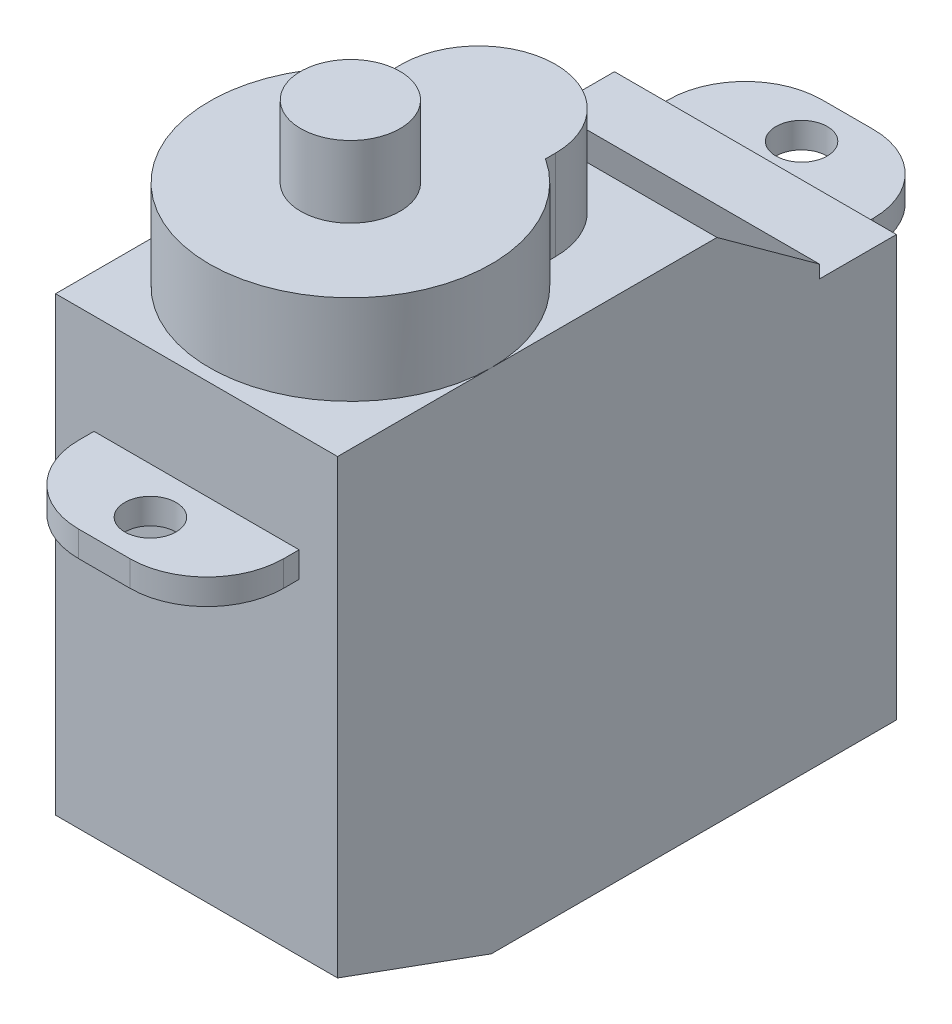
ISO-10303-21;
HEADER;
FILE_DESCRIPTION(('STEP AP214'),'2;1');
FILE_NAME('part.step','',(''),(''),'','','');
FILE_SCHEMA(('AUTOMOTIVE_DESIGN { 1 0 10303 214 1 1 1 1 }'));
ENDSEC;
DATA;
#1=APPLICATION_CONTEXT('core data for automotive mechanical design processes');
#2=APPLICATION_PROTOCOL_DEFINITION('international standard','automotive_design',2000,#1);
#3=PRODUCT_CONTEXT('',#1,'mechanical');
#4=PRODUCT('Part','Part','',(#3));
#5=PRODUCT_RELATED_PRODUCT_CATEGORY('part','',(#4));
#6=PRODUCT_DEFINITION_FORMATION('','',#4);
#7=PRODUCT_DEFINITION_CONTEXT('part definition',#1,'design');
#8=PRODUCT_DEFINITION('design','',#6,#7);
#9=PRODUCT_DEFINITION_SHAPE('','',#8);
#10=(LENGTH_UNIT() NAMED_UNIT(*) SI_UNIT(.MILLI.,.METRE.));
#11=(NAMED_UNIT(*) PLANE_ANGLE_UNIT() SI_UNIT($,.RADIAN.));
#12=(NAMED_UNIT(*) SI_UNIT($,.STERADIAN.) SOLID_ANGLE_UNIT());
#13=UNCERTAINTY_MEASURE_WITH_UNIT(LENGTH_MEASURE(1.E-05),#10,'distance_accuracy_value','');
#14=(GEOMETRIC_REPRESENTATION_CONTEXT(3) GLOBAL_UNCERTAINTY_ASSIGNED_CONTEXT((#13)) GLOBAL_UNIT_ASSIGNED_CONTEXT((#10,
#11,#12)) REPRESENTATION_CONTEXT('',''));
#15=CARTESIAN_POINT('',(0.,0.,0.));
#16=DIRECTION('',(0.,0.,1.));
#17=DIRECTION('',(1.,0.,0.));
#18=AXIS2_PLACEMENT_3D('',#15,#16,#17);
#19=CARTESIAN_POINT('',(0.,11.1939999999994,0.));
#20=DIRECTION('',(0.,1.,0.));
#21=DIRECTION('',(0.,0.,1.));
#22=AXIS2_PLACEMENT_3D('',#19,#20,#21);
#23=PLANE('',#22);
#24=CARTESIAN_POINT('',(0.,11.1939999999994,0.));
#25=DIRECTION('',(0.,1.,0.));
#26=DIRECTION('',(0.,0.,1.));
#27=AXIS2_PLACEMENT_3D('',#24,#25,#26);
#28=CIRCLE('',#27,1.93675);
#29=CARTESIAN_POINT('',(0.,11.1939999999994,1.93675));
#30=VERTEX_POINT('',#29);
#31=EDGE_CURVE('E19',#30,#30,#28,.F.);
#32=ORIENTED_EDGE('',*,*,#31,.F.);
#33=EDGE_LOOP('',(#32));
#34=FACE_BOUND('',#33,.T.);
#35=ADVANCED_FACE('F16',(#34),#23,.T.);
#36=CARTESIAN_POINT('',(0.,8.39999999999942,0.));
#37=DIRECTION('',(0.,1.,0.));
#38=DIRECTION('',(0.,0.,1.));
#39=AXIS2_PLACEMENT_3D('',#36,#37,#38);
#40=CYLINDRICAL_SURFACE('',#39,1.93675);
#41=ORIENTED_EDGE('',*,*,#31,.T.);
#42=EDGE_LOOP('',(#41));
#43=FACE_BOUND('',#42,.T.);
#44=CARTESIAN_POINT('',(0.,8.39999999999942,0.));
#45=DIRECTION('',(0.,1.,0.));
#46=DIRECTION('',(0.,0.,1.));
#47=AXIS2_PLACEMENT_3D('',#44,#45,#46);
#48=CIRCLE('',#47,1.93675);
#49=CARTESIAN_POINT('',(0.,8.39999999999942,1.93675));
#50=VERTEX_POINT('',#49);
#51=EDGE_CURVE('E196',#50,#50,#48,.F.);
#52=ORIENTED_EDGE('',*,*,#51,.F.);
#53=EDGE_LOOP('',(#52));
#54=FACE_BOUND('',#53,.T.);
#55=ADVANCED_FACE('F343',(#43,#54),#40,.T.);
#56=CARTESIAN_POINT('',(3.0000000000007,0.,-4.6097722286464));
#57=DIRECTION('',(1.,0.,0.));
#58=DIRECTION('',(0.,0.,-1.));
#59=AXIS2_PLACEMENT_3D('',#56,#57,#58);
#60=PLANE('',#59);
#61=DIRECTION('',(0.,1.,0.));
#62=VECTOR('',#61,1.);
#63=CARTESIAN_POINT('',(3.00000000000098,0.,-4.60977222864683));
#64=LINE('',#63,#62);
#65=CARTESIAN_POINT('',(3.00000000000084,4.90000000000072,-4.60977222864692));
#66=VERTEX_POINT('',#65);
#67=CARTESIAN_POINT('',(3.00000000000084,8.39999999999942,-4.60977222864692));
#68=VERTEX_POINT('',#67);
#69=EDGE_CURVE('E208',#66,#68,#64,.T.);
#70=ORIENTED_EDGE('',*,*,#69,.F.);
#71=DIRECTION('',(0.,0.,-1.));
#72=VECTOR('',#71,1.);
#73=CARTESIAN_POINT('',(3.0000000000007,4.90000000000072,-4.6097722286464));
#74=LINE('',#73,#72);
#75=CARTESIAN_POINT('',(3.0000000000007,4.90000000000072,-5.00000000000032));
#76=VERTEX_POINT('',#75);
#77=EDGE_CURVE('E197',#66,#76,#74,.T.);
#78=ORIENTED_EDGE('',*,*,#77,.T.);
#79=DIRECTION('',(0.,1.,0.));
#80=VECTOR('',#79,1.);
#81=CARTESIAN_POINT('',(3.0000000000007,0.,-5.00000000000032));
#82=LINE('',#81,#80);
#83=CARTESIAN_POINT('',(3.0000000000007,8.39999999999942,-5.00000000000032));
#84=VERTEX_POINT('',#83);
#85=EDGE_CURVE('E203',#84,#76,#82,.F.);
#86=ORIENTED_EDGE('',*,*,#85,.F.);
#87=DIRECTION('',(0.,0.,1.));
#88=VECTOR('',#87,1.);
#89=CARTESIAN_POINT('',(3.0000000000007,8.39999999999942,0.));
#90=LINE('',#89,#88);
#91=EDGE_CURVE('E188',#68,#84,#90,.F.);
#92=ORIENTED_EDGE('',*,*,#91,.F.);
#93=EDGE_LOOP('',(#70,#78,#86,#92));
#94=FACE_BOUND('',#93,.T.);
#95=ADVANCED_FACE('F207',(#94),#60,.T.);
#96=CARTESIAN_POINT('',(0.,8.39999999999942,0.));
#97=DIRECTION('',(0.,1.,0.));
#98=DIRECTION('',(0.,0.,1.));
#99=AXIS2_PLACEMENT_3D('',#96,#97,#98);
#100=PLANE('',#99);
#101=ORIENTED_EDGE('',*,*,#51,.T.);
#102=EDGE_LOOP('',(#101));
#103=FACE_BOUND('',#102,.T.);
#104=CARTESIAN_POINT('',(0.,8.39999999999942,-5.00000000000032));
#105=DIRECTION('',(0.,1.,0.));
#106=DIRECTION('',(0.,0.,1.));
#107=AXIS2_PLACEMENT_3D('',#104,#105,#106);
#108=CIRCLE('',#107,3.0000000000007);
#109=CARTESIAN_POINT('',(-3.0000000000007,8.39999999999942,-5.00000000000032));
#110=VERTEX_POINT('',#109);
#111=EDGE_CURVE('E191',#110,#84,#108,.F.);
#112=ORIENTED_EDGE('',*,*,#111,.F.);
#113=DIRECTION('',(0.,0.,1.));
#114=VECTOR('',#113,1.);
#115=CARTESIAN_POINT('',(-3.0000000000007,8.39999999999942,-5.00000000000032));
#116=LINE('',#115,#114);
#117=CARTESIAN_POINT('',(-3.00000000000084,8.39999999999942,-4.60977222864692));
#118=VERTEX_POINT('',#117);
#119=EDGE_CURVE('E181',#118,#110,#116,.F.);
#120=ORIENTED_EDGE('',*,*,#119,.F.);
#121=CARTESIAN_POINT('',(0.,8.39999999999942,0.));
#122=DIRECTION('',(0.,1.,0.));
#123=DIRECTION('',(0.,0.,1.));
#124=AXIS2_PLACEMENT_3D('',#121,#122,#123);
#125=CIRCLE('',#124,5.50000000000086);
#126=EDGE_CURVE('E192',#68,#118,#125,.F.);
#127=ORIENTED_EDGE('',*,*,#126,.F.);
#128=ORIENTED_EDGE('',*,*,#91,.T.);
#129=EDGE_LOOP('',(#112,#120,#127,#128));
#130=FACE_BOUND('',#129,.T.);
#131=ADVANCED_FACE('F190',(#103,#130),#100,.T.);
#132=CARTESIAN_POINT('',(-3.0000000000007,0.,-5.00000000000032));
#133=DIRECTION('',(-1.,0.,0.));
#134=DIRECTION('',(0.,0.,1.));
#135=AXIS2_PLACEMENT_3D('',#132,#133,#134);
#136=PLANE('',#135);
#137=DIRECTION('',(0.,1.,0.));
#138=VECTOR('',#137,1.);
#139=CARTESIAN_POINT('',(-3.0000000000007,0.,-5.00000000000032));
#140=LINE('',#139,#138);
#141=CARTESIAN_POINT('',(-3.0000000000007,4.90000000000072,-5.00000000000032));
#142=VERTEX_POINT('',#141);
#143=EDGE_CURVE('E205',#142,#110,#140,.T.);
#144=ORIENTED_EDGE('',*,*,#143,.F.);
#145=DIRECTION('',(0.,0.,1.));
#146=VECTOR('',#145,1.);
#147=CARTESIAN_POINT('',(-3.0000000000007,4.90000000000072,-5.00000000000032));
#148=LINE('',#147,#146);
#149=CARTESIAN_POINT('',(-3.00000000000084,4.90000000000072,-4.60977222864692));
#150=VERTEX_POINT('',#149);
#151=EDGE_CURVE('E253',#142,#150,#148,.T.);
#152=ORIENTED_EDGE('',*,*,#151,.T.);
#153=DIRECTION('',(0.,1.,0.));
#154=VECTOR('',#153,1.);
#155=CARTESIAN_POINT('',(-3.00000000000098,0.,-4.60977222864683));
#156=LINE('',#155,#154);
#157=EDGE_CURVE('E258',#118,#150,#156,.F.);
#158=ORIENTED_EDGE('',*,*,#157,.F.);
#159=ORIENTED_EDGE('',*,*,#119,.T.);
#160=EDGE_LOOP('',(#144,#152,#158,#159));
#161=FACE_BOUND('',#160,.T.);
#162=ADVANCED_FACE('F469',(#161),#136,.T.);
#163=CARTESIAN_POINT('',(1.00000000000006,30.7112799999994,6.599999999999));
#164=DIRECTION('',(0.,-1.,0.));
#165=DIRECTION('',(0.,0.,-1.));
#166=AXIS2_PLACEMENT_3D('',#163,#164,#165);
#167=CYLINDRICAL_SURFACE('',#166,3.0000000000007);
#168=DIRECTION('',(0.,1.,0.));
#169=VECTOR('',#168,1.);
#170=CARTESIAN_POINT('',(1.00000000000006,0.,9.5999999999997));
#171=LINE('',#170,#169);
#172=CARTESIAN_POINT('',(1.00000000000006,0.,9.5999999999997));
#173=VERTEX_POINT('',#172);
#174=CARTESIAN_POINT('',(1.00000000000006,1.00000000000006,9.5999999999997));
#175=VERTEX_POINT('',#174);
#176=EDGE_CURVE('E242',#173,#175,#171,.T.);
#177=ORIENTED_EDGE('',*,*,#176,.F.);
#178=CARTESIAN_POINT('',(1.00000000000006,0.,6.599999999999));
#179=DIRECTION('',(0.,-1.,0.));
#180=DIRECTION('',(0.,0.,-1.));
#181=AXIS2_PLACEMENT_3D('',#178,#179,#180);
#182=CIRCLE('',#181,3.0000000000007);
#183=CARTESIAN_POINT('',(3.99999999999924,0.,6.599999999999));
#184=VERTEX_POINT('',#183);
#185=EDGE_CURVE('E274',#173,#184,#182,.F.);
#186=ORIENTED_EDGE('',*,*,#185,.T.);
#187=DIRECTION('',(0.,1.,0.));
#188=VECTOR('',#187,1.);
#189=CARTESIAN_POINT('',(3.99999999999924,0.,6.599999999999));
#190=LINE('',#189,#188);
#191=CARTESIAN_POINT('',(3.99999999999924,1.00000000000006,6.599999999999));
#192=VERTEX_POINT('',#191);
#193=EDGE_CURVE('E272',#192,#184,#190,.F.);
#194=ORIENTED_EDGE('',*,*,#193,.F.);
#195=CARTESIAN_POINT('',(1.00000000000006,1.00000000000006,6.599999999999));
#196=DIRECTION('',(0.,-1.,0.));
#197=DIRECTION('',(0.,0.,-1.));
#198=AXIS2_PLACEMENT_3D('',#195,#196,#197);
#199=CIRCLE('',#198,3.0000000000007);
#200=EDGE_CURVE('E334',#175,#192,#199,.F.);
#201=ORIENTED_EDGE('',*,*,#200,.F.);
#202=EDGE_LOOP('',(#177,#186,#194,#201));
#203=FACE_BOUND('',#202,.T.);
#204=ADVANCED_FACE('F465',(#203),#167,.T.);
#205=CARTESIAN_POINT('',(-1.00000000000006,30.7112799999994,6.599999999999));
#206=DIRECTION('',(0.,-1.,0.));
#207=DIRECTION('',(0.,0.,-1.));
#208=AXIS2_PLACEMENT_3D('',#205,#206,#207);
#209=CYLINDRICAL_SURFACE('',#208,3.0000000000007);
#210=DIRECTION('',(0.,1.,0.));
#211=VECTOR('',#210,1.);
#212=CARTESIAN_POINT('',(-3.99999999999924,0.,6.599999999999));
#213=LINE('',#212,#211);
#214=CARTESIAN_POINT('',(-3.99999999999924,0.,6.599999999999));
#215=VERTEX_POINT('',#214);
#216=CARTESIAN_POINT('',(-3.99999999999924,1.00000000000006,6.599999999999));
#217=VERTEX_POINT('',#216);
#218=EDGE_CURVE('E255',#215,#217,#213,.T.);
#219=ORIENTED_EDGE('',*,*,#218,.F.);
#220=CARTESIAN_POINT('',(-1.00000000000006,0.,6.599999999999));
#221=DIRECTION('',(0.,-1.,0.));
#222=DIRECTION('',(0.,0.,-1.));
#223=AXIS2_PLACEMENT_3D('',#220,#221,#222);
#224=CIRCLE('',#223,3.0000000000007);
#225=CARTESIAN_POINT('',(-1.00000000000006,0.,9.5999999999997));
#226=VERTEX_POINT('',#225);
#227=EDGE_CURVE('E325',#215,#226,#224,.F.);
#228=ORIENTED_EDGE('',*,*,#227,.T.);
#229=DIRECTION('',(0.,1.,0.));
#230=VECTOR('',#229,1.);
#231=CARTESIAN_POINT('',(-1.00000000000006,0.,9.5999999999997));
#232=LINE('',#231,#230);
#233=CARTESIAN_POINT('',(-1.00000000000006,1.00000000000006,9.5999999999997));
#234=VERTEX_POINT('',#233);
#235=EDGE_CURVE('E251',#234,#226,#232,.F.);
#236=ORIENTED_EDGE('',*,*,#235,.F.);
#237=CARTESIAN_POINT('',(-1.00000000000006,1.00000000000006,6.599999999999));
#238=DIRECTION('',(0.,-1.,0.));
#239=DIRECTION('',(0.,0.,-1.));
#240=AXIS2_PLACEMENT_3D('',#237,#238,#239);
#241=CIRCLE('',#240,3.0000000000007);
#242=EDGE_CURVE('E337',#217,#234,#241,.F.);
#243=ORIENTED_EDGE('',*,*,#242,.F.);
#244=EDGE_LOOP('',(#219,#228,#236,#243));
#245=FACE_BOUND('',#244,.T.);
#246=ADVANCED_FACE('F461',(#245),#209,.T.);
#247=CARTESIAN_POINT('',(-3.99999999999924,0.,9.5999999999997));
#248=DIRECTION('',(0.,0.,1.));
#249=DIRECTION('',(1.,0.,0.));
#250=AXIS2_PLACEMENT_3D('',#247,#248,#249);
#251=PLANE('',#250);
#252=DIRECTION('',(1.,0.,0.));
#253=VECTOR('',#252,1.);
#254=CARTESIAN_POINT('',(0.,0.,9.5999999999997));
#255=LINE('',#254,#253);
#256=EDGE_CURVE('E324',#226,#173,#255,.T.);
#257=ORIENTED_EDGE('',*,*,#256,.T.);
#258=ORIENTED_EDGE('',*,*,#176,.T.);
#259=DIRECTION('',(1.,0.,0.));
#260=VECTOR('',#259,1.);
#261=CARTESIAN_POINT('',(0.,1.00000000000006,9.5999999999997));
#262=LINE('',#261,#260);
#263=EDGE_CURVE('E336',#234,#175,#262,.T.);
#264=ORIENTED_EDGE('',*,*,#263,.F.);
#265=ORIENTED_EDGE('',*,*,#235,.T.);
#266=EDGE_LOOP('',(#257,#258,#264,#265));
#267=FACE_BOUND('',#266,.T.);
#268=ADVANCED_FACE('F457',(#267),#251,.T.);
#269=CARTESIAN_POINT('',(0.,0.,7.79999999999928));
#270=DIRECTION('',(0.,1.,0.));
#271=DIRECTION('',(0.,0.,1.));
#272=AXIS2_PLACEMENT_3D('',#269,#270,#271);
#273=CYLINDRICAL_SURFACE('',#272,1.00000000000006);
#274=CARTESIAN_POINT('',(0.,1.00000000000006,7.79999999999928));
#275=DIRECTION('',(0.,1.,0.));
#276=DIRECTION('',(0.,0.,1.));
#277=AXIS2_PLACEMENT_3D('',#274,#275,#276);
#278=CIRCLE('',#277,1.00000000000006);
#279=CARTESIAN_POINT('',(0.,1.00000000000006,8.79999999999934));
#280=VERTEX_POINT('',#279);
#281=EDGE_CURVE('E281',#280,#280,#278,.F.);
#282=ORIENTED_EDGE('',*,*,#281,.F.);
#283=EDGE_LOOP('',(#282));
#284=FACE_BOUND('',#283,.T.);
#285=CARTESIAN_POINT('',(0.,0.,7.79999999999928));
#286=DIRECTION('',(0.,1.,0.));
#287=DIRECTION('',(0.,0.,1.));
#288=AXIS2_PLACEMENT_3D('',#285,#286,#287);
#289=CIRCLE('',#288,1.00000000000006);
#290=CARTESIAN_POINT('',(0.,0.,8.79999999999934));
#291=VERTEX_POINT('',#290);
#292=EDGE_CURVE('E218',#291,#291,#289,.F.);
#293=ORIENTED_EDGE('',*,*,#292,.T.);
#294=EDGE_LOOP('',(#293));
#295=FACE_BOUND('',#294,.T.);
#296=ADVANCED_FACE('F453',(#284,#295),#273,.F.);
#297=CARTESIAN_POINT('',(1.00000000000006,30.7112799999994,-16.4000000000004));
#298=DIRECTION('',(0.,-1.,0.));
#299=DIRECTION('',(0.,0.,-1.));
#300=AXIS2_PLACEMENT_3D('',#297,#298,#299);
#301=CYLINDRICAL_SURFACE('',#300,3.0000000000007);
#302=DIRECTION('',(0.,1.,0.));
#303=VECTOR('',#302,1.);
#304=CARTESIAN_POINT('',(3.99999999999924,0.,-16.4000000000004));
#305=LINE('',#304,#303);
#306=CARTESIAN_POINT('',(3.99999999999924,0.,-16.4000000000004));
#307=VERTEX_POINT('',#306);
#308=CARTESIAN_POINT('',(3.99999999999924,1.00000000000006,-16.4000000000004));
#309=VERTEX_POINT('',#308);
#310=EDGE_CURVE('E215',#307,#309,#305,.T.);
#311=ORIENTED_EDGE('',*,*,#310,.F.);
#312=CARTESIAN_POINT('',(1.00000000000006,0.,-16.4000000000004));
#313=DIRECTION('',(0.,-1.,0.));
#314=DIRECTION('',(0.,0.,-1.));
#315=AXIS2_PLACEMENT_3D('',#312,#313,#314);
#316=CIRCLE('',#315,3.0000000000007);
#317=CARTESIAN_POINT('',(1.00000000000006,0.,-19.4000000000011));
#318=VERTEX_POINT('',#317);
#319=EDGE_CURVE('E234',#307,#318,#316,.F.);
#320=ORIENTED_EDGE('',*,*,#319,.T.);
#321=DIRECTION('',(0.,1.,0.));
#322=VECTOR('',#321,1.);
#323=CARTESIAN_POINT('',(1.00000000000006,0.,-19.4000000000011));
#324=LINE('',#323,#322);
#325=CARTESIAN_POINT('',(1.00000000000006,1.00000000000006,-19.4000000000011));
#326=VERTEX_POINT('',#325);
#327=EDGE_CURVE('E240',#326,#318,#324,.F.);
#328=ORIENTED_EDGE('',*,*,#327,.F.);
#329=CARTESIAN_POINT('',(1.00000000000006,1.00000000000006,-16.4000000000004));
#330=DIRECTION('',(0.,-1.,0.));
#331=DIRECTION('',(0.,0.,-1.));
#332=AXIS2_PLACEMENT_3D('',#329,#330,#331);
#333=CIRCLE('',#332,3.0000000000007);
#334=EDGE_CURVE('E316',#309,#326,#333,.F.);
#335=ORIENTED_EDGE('',*,*,#334,.F.);
#336=EDGE_LOOP('',(#311,#320,#328,#335));
#337=FACE_BOUND('',#336,.T.);
#338=ADVANCED_FACE('F449',(#337),#301,.T.);
#339=CARTESIAN_POINT('',(3.99999999999924,0.,-19.4000000000011));
#340=DIRECTION('',(0.,0.,-1.));
#341=DIRECTION('',(-1.,0.,0.));
#342=AXIS2_PLACEMENT_3D('',#339,#340,#341);
#343=PLANE('',#342);
#344=DIRECTION('',(1.,0.,0.));
#345=VECTOR('',#344,1.);
#346=CARTESIAN_POINT('',(0.,1.00000000000006,-19.4000000000011));
#347=LINE('',#346,#345);
#348=CARTESIAN_POINT('',(-1.00000000000006,1.00000000000006,-19.4000000000011));
#349=VERTEX_POINT('',#348);
#350=EDGE_CURVE('E217',#326,#349,#347,.F.);
#351=ORIENTED_EDGE('',*,*,#350,.F.);
#352=ORIENTED_EDGE('',*,*,#327,.T.);
#353=DIRECTION('',(1.,0.,0.));
#354=VECTOR('',#353,1.);
#355=CARTESIAN_POINT('',(0.,0.,-19.4000000000011));
#356=LINE('',#355,#354);
#357=CARTESIAN_POINT('',(-1.00000000000006,0.,-19.4000000000011));
#358=VERTEX_POINT('',#357);
#359=EDGE_CURVE('E311',#318,#358,#356,.F.);
#360=ORIENTED_EDGE('',*,*,#359,.T.);
#361=DIRECTION('',(0.,-1.,0.));
#362=VECTOR('',#361,1.);
#363=CARTESIAN_POINT('',(-1.00000000000006,30.7112799999994,-19.4000000000011));
#364=LINE('',#363,#362);
#365=EDGE_CURVE('E214',#349,#358,#364,.T.);
#366=ORIENTED_EDGE('',*,*,#365,.F.);
#367=EDGE_LOOP('',(#351,#352,#360,#366));
#368=FACE_BOUND('',#367,.T.);
#369=ADVANCED_FACE('F445',(#368),#343,.T.);
#370=CARTESIAN_POINT('',(-1.00000000000006,30.7112799999994,-16.4000000000004));
#371=DIRECTION('',(0.,-1.,0.));
#372=DIRECTION('',(0.,0.,-1.));
#373=AXIS2_PLACEMENT_3D('',#370,#371,#372);
#374=CYLINDRICAL_SURFACE('',#373,3.0000000000007);
#375=ORIENTED_EDGE('',*,*,#365,.T.);
#376=CARTESIAN_POINT('',(-1.00000000000006,0.,-16.4000000000004));
#377=DIRECTION('',(0.,-1.,0.));
#378=DIRECTION('',(0.,0.,-1.));
#379=AXIS2_PLACEMENT_3D('',#376,#377,#378);
#380=CIRCLE('',#379,3.0000000000007);
#381=CARTESIAN_POINT('',(-3.99999999999924,0.,-16.4000000000004));
#382=VERTEX_POINT('',#381);
#383=EDGE_CURVE('E307',#358,#382,#380,.F.);
#384=ORIENTED_EDGE('',*,*,#383,.T.);
#385=DIRECTION('',(0.,1.,0.));
#386=VECTOR('',#385,1.);
#387=CARTESIAN_POINT('',(-3.99999999999924,0.,-16.4000000000004));
#388=LINE('',#387,#386);
#389=CARTESIAN_POINT('',(-3.99999999999924,1.00000000000006,-16.4000000000004));
#390=VERTEX_POINT('',#389);
#391=EDGE_CURVE('E232',#390,#382,#388,.F.);
#392=ORIENTED_EDGE('',*,*,#391,.F.);
#393=CARTESIAN_POINT('',(-1.00000000000006,1.00000000000006,-16.4000000000004));
#394=DIRECTION('',(0.,-1.,0.));
#395=DIRECTION('',(0.,0.,-1.));
#396=AXIS2_PLACEMENT_3D('',#393,#394,#395);
#397=CIRCLE('',#396,3.0000000000007);
#398=EDGE_CURVE('E320',#349,#390,#397,.F.);
#399=ORIENTED_EDGE('',*,*,#398,.F.);
#400=EDGE_LOOP('',(#375,#384,#392,#399));
#401=FACE_BOUND('',#400,.T.);
#402=ADVANCED_FACE('F441',(#401),#374,.T.);
#403=CARTESIAN_POINT('',(0.,0.,-17.6000000000007));
#404=DIRECTION('',(0.,1.,0.));
#405=DIRECTION('',(0.,0.,1.));
#406=AXIS2_PLACEMENT_3D('',#403,#404,#405);
#407=CYLINDRICAL_SURFACE('',#406,1.00000000000006);
#408=CARTESIAN_POINT('',(0.,1.00000000000006,-17.6000000000007));
#409=DIRECTION('',(0.,1.,0.));
#410=DIRECTION('',(0.,0.,1.));
#411=AXIS2_PLACEMENT_3D('',#408,#409,#410);
#412=CIRCLE('',#411,1.00000000000006);
#413=CARTESIAN_POINT('',(0.,1.00000000000006,-16.6000000000007));
#414=VERTEX_POINT('',#413);
#415=EDGE_CURVE('E245',#414,#414,#412,.F.);
#416=ORIENTED_EDGE('',*,*,#415,.F.);
#417=EDGE_LOOP('',(#416));
#418=FACE_BOUND('',#417,.T.);
#419=CARTESIAN_POINT('',(0.,0.,-17.6000000000007));
#420=DIRECTION('',(0.,1.,0.));
#421=DIRECTION('',(0.,0.,1.));
#422=AXIS2_PLACEMENT_3D('',#419,#420,#421);
#423=CIRCLE('',#422,1.00000000000006);
#424=CARTESIAN_POINT('',(0.,0.,-16.6000000000007));
#425=VERTEX_POINT('',#424);
#426=EDGE_CURVE('E302',#425,#425,#423,.F.);
#427=ORIENTED_EDGE('',*,*,#426,.T.);
#428=EDGE_LOOP('',(#427));
#429=FACE_BOUND('',#428,.T.);
#430=ADVANCED_FACE('F438',(#418,#429),#407,.F.);
#431=CARTESIAN_POINT('',(0.,0.,-5.00000000000032));
#432=DIRECTION('',(0.,1.,0.));
#433=DIRECTION('',(0.,0.,1.));
#434=AXIS2_PLACEMENT_3D('',#431,#432,#433);
#435=CYLINDRICAL_SURFACE('',#434,3.0000000000007);
#436=ORIENTED_EDGE('',*,*,#85,.T.);
#437=CARTESIAN_POINT('',(0.,4.90000000000072,-5.00000000000032));
#438=DIRECTION('',(0.,1.,0.));
#439=DIRECTION('',(0.,0.,1.));
#440=AXIS2_PLACEMENT_3D('',#437,#438,#439);
#441=CIRCLE('',#440,3.0000000000007);
#442=EDGE_CURVE('E300',#142,#76,#441,.F.);
#443=ORIENTED_EDGE('',*,*,#442,.F.);
#444=ORIENTED_EDGE('',*,*,#143,.T.);
#445=ORIENTED_EDGE('',*,*,#111,.T.);
#446=EDGE_LOOP('',(#436,#443,#444,#445));
#447=FACE_BOUND('',#446,.T.);
#448=ADVANCED_FACE('F201',(#447),#435,.T.);
#449=CARTESIAN_POINT('',(0.,0.,0.));
#450=DIRECTION('',(0.,1.,0.));
#451=DIRECTION('',(0.,0.,1.));
#452=AXIS2_PLACEMENT_3D('',#449,#450,#451);
#453=CYLINDRICAL_SURFACE('',#452,5.50000000000086);
#454=ORIENTED_EDGE('',*,*,#157,.T.);
#455=CARTESIAN_POINT('',(0.,4.90000000000072,0.));
#456=DIRECTION('',(0.,1.,0.));
#457=DIRECTION('',(0.,0.,1.));
#458=AXIS2_PLACEMENT_3D('',#455,#456,#457);
#459=CIRCLE('',#458,5.50000000000086);
#460=CARTESIAN_POINT('',(-5.50000000000086,4.90000000000072,0.));
#461=VERTEX_POINT('',#460);
#462=EDGE_CURVE('E294',#461,#150,#459,.F.);
#463=ORIENTED_EDGE('',*,*,#462,.F.);
#464=CARTESIAN_POINT('',(0.,4.90000000000072,0.));
#465=DIRECTION('',(0.,1.,0.));
#466=DIRECTION('',(0.,0.,1.));
#467=AXIS2_PLACEMENT_3D('',#464,#465,#466);
#468=CIRCLE('',#467,5.50000000000086);
#469=CARTESIAN_POINT('',(5.50000000000086,4.90000000000072,0.));
#470=VERTEX_POINT('',#469);
#471=EDGE_CURVE('E290',#470,#461,#468,.F.);
#472=ORIENTED_EDGE('',*,*,#471,.F.);
#473=CARTESIAN_POINT('',(0.,4.90000000000072,0.));
#474=DIRECTION('',(0.,1.,0.));
#475=DIRECTION('',(0.,0.,1.));
#476=AXIS2_PLACEMENT_3D('',#473,#474,#475);
#477=CIRCLE('',#476,5.50000000000086);
#478=EDGE_CURVE('E298',#66,#470,#477,.F.);
#479=ORIENTED_EDGE('',*,*,#478,.F.);
#480=ORIENTED_EDGE('',*,*,#69,.T.);
#481=ORIENTED_EDGE('',*,*,#126,.T.);
#482=EDGE_LOOP('',(#454,#463,#472,#479,#480,#481));
#483=FACE_BOUND('',#482,.T.);
#484=ADVANCED_FACE('F431',(#483),#453,.T.);
#485=CARTESIAN_POINT('',(-3.99999999999924,0.,-19.4000000000011));
#486=DIRECTION('',(-1.,0.,0.));
#487=DIRECTION('',(0.,0.,1.));
#488=AXIS2_PLACEMENT_3D('',#485,#486,#487);
#489=PLANE('',#488);
#490=DIRECTION('',(0.,0.,1.));
#491=VECTOR('',#490,1.);
#492=CARTESIAN_POINT('',(-3.99999999999924,0.,0.));
#493=LINE('',#492,#491);
#494=CARTESIAN_POINT('',(-3.99999999999924,0.,5.99999999999886));
#495=VERTEX_POINT('',#494);
#496=EDGE_CURVE('E328',#495,#215,#493,.T.);
#497=ORIENTED_EDGE('',*,*,#496,.T.);
#498=ORIENTED_EDGE('',*,*,#218,.T.);
#499=DIRECTION('',(0.,0.,1.));
#500=VECTOR('',#499,1.);
#501=CARTESIAN_POINT('',(-3.99999999999924,1.00000000000006,0.));
#502=LINE('',#501,#500);
#503=CARTESIAN_POINT('',(-3.99999999999924,1.00000000000006,5.99999999999886));
#504=VERTEX_POINT('',#503);
#505=EDGE_CURVE('E257',#504,#217,#502,.T.);
#506=ORIENTED_EDGE('',*,*,#505,.F.);
#507=DIRECTION('',(0.,1.,0.));
#508=VECTOR('',#507,1.);
#509=CARTESIAN_POINT('',(-3.99999999999924,4.90000000000072,5.99999999999886));
#510=LINE('',#509,#508);
#511=EDGE_CURVE('E266',#495,#504,#510,.T.);
#512=ORIENTED_EDGE('',*,*,#511,.F.);
#513=EDGE_LOOP('',(#497,#498,#506,#512));
#514=FACE_BOUND('',#513,.T.);
#515=ADVANCED_FACE('F427',(#514),#489,.T.);
#516=CARTESIAN_POINT('',(0.,1.00000000000006,0.));
#517=DIRECTION('',(0.,1.,0.));
#518=DIRECTION('',(0.,0.,1.));
#519=AXIS2_PLACEMENT_3D('',#516,#517,#518);
#520=PLANE('',#519);
#521=ORIENTED_EDGE('',*,*,#281,.T.);
#522=EDGE_LOOP('',(#521));
#523=FACE_BOUND('',#522,.T.);
#524=ORIENTED_EDGE('',*,*,#263,.T.);
#525=ORIENTED_EDGE('',*,*,#200,.T.);
#526=DIRECTION('',(0.,0.,-1.));
#527=VECTOR('',#526,1.);
#528=CARTESIAN_POINT('',(3.99999999999924,1.00000000000006,9.5999999999997));
#529=LINE('',#528,#527);
#530=CARTESIAN_POINT('',(3.99999999999924,1.00000000000006,5.99999999999886));
#531=VERTEX_POINT('',#530);
#532=EDGE_CURVE('E275',#531,#192,#529,.F.);
#533=ORIENTED_EDGE('',*,*,#532,.F.);
#534=DIRECTION('',(1.,0.,0.));
#535=VECTOR('',#534,1.);
#536=CARTESIAN_POINT('',(-5.50000000000086,1.00000000000006,5.99999999999886));
#537=LINE('',#536,#535);
#538=EDGE_CURVE('E268',#504,#531,#537,.T.);
#539=ORIENTED_EDGE('',*,*,#538,.F.);
#540=ORIENTED_EDGE('',*,*,#505,.T.);
#541=ORIENTED_EDGE('',*,*,#242,.T.);
#542=EDGE_LOOP('',(#524,#525,#533,#539,#540,#541));
#543=FACE_BOUND('',#542,.T.);
#544=ADVANCED_FACE('F423',(#523,#543),#520,.T.);
#545=CARTESIAN_POINT('',(3.99999999999924,0.,9.5999999999997));
#546=DIRECTION('',(1.,0.,0.));
#547=DIRECTION('',(0.,0.,-1.));
#548=AXIS2_PLACEMENT_3D('',#545,#546,#547);
#549=PLANE('',#548);
#550=ORIENTED_EDGE('',*,*,#532,.T.);
#551=ORIENTED_EDGE('',*,*,#193,.T.);
#552=DIRECTION('',(0.,0.,1.));
#553=VECTOR('',#552,1.);
#554=CARTESIAN_POINT('',(3.99999999999924,0.,0.));
#555=LINE('',#554,#553);
#556=CARTESIAN_POINT('',(3.99999999999924,0.,5.99999999999886));
#557=VERTEX_POINT('',#556);
#558=EDGE_CURVE('E331',#184,#557,#555,.F.);
#559=ORIENTED_EDGE('',*,*,#558,.T.);
#560=DIRECTION('',(0.,1.,0.));
#561=VECTOR('',#560,1.);
#562=CARTESIAN_POINT('',(3.99999999999924,4.90000000000072,5.99999999999886));
#563=LINE('',#562,#561);
#564=EDGE_CURVE('E263',#531,#557,#563,.F.);
#565=ORIENTED_EDGE('',*,*,#564,.F.);
#566=EDGE_LOOP('',(#550,#551,#559,#565));
#567=FACE_BOUND('',#566,.T.);
#568=ADVANCED_FACE('F419',(#567),#549,.T.);
#569=CARTESIAN_POINT('',(0.,0.,0.));
#570=DIRECTION('',(0.,1.,0.));
#571=DIRECTION('',(0.,0.,1.));
#572=AXIS2_PLACEMENT_3D('',#569,#570,#571);
#573=PLANE('',#572);
#574=ORIENTED_EDGE('',*,*,#292,.F.);
#575=EDGE_LOOP('',(#574));
#576=FACE_BOUND('',#575,.T.);
#577=ORIENTED_EDGE('',*,*,#227,.F.);
#578=ORIENTED_EDGE('',*,*,#496,.F.);
#579=DIRECTION('',(1.,0.,0.));
#580=VECTOR('',#579,1.);
#581=CARTESIAN_POINT('',(-5.50000000000086,0.,5.99999999999886));
#582=LINE('',#581,#580);
#583=EDGE_CURVE('E259',#557,#495,#582,.F.);
#584=ORIENTED_EDGE('',*,*,#583,.F.);
#585=ORIENTED_EDGE('',*,*,#558,.F.);
#586=ORIENTED_EDGE('',*,*,#185,.F.);
#587=ORIENTED_EDGE('',*,*,#256,.F.);
#588=EDGE_LOOP('',(#577,#578,#584,#585,#586,#587));
#589=FACE_BOUND('',#588,.T.);
#590=ADVANCED_FACE('F415',(#576,#589),#573,.F.);
#591=CARTESIAN_POINT('',(3.99999999999924,0.,9.5999999999997));
#592=DIRECTION('',(1.,0.,0.));
#593=DIRECTION('',(0.,0.,-1.));
#594=AXIS2_PLACEMENT_3D('',#591,#592,#593);
#595=PLANE('',#594);
#596=DIRECTION('',(0.,0.,1.));
#597=VECTOR('',#596,1.);
#598=CARTESIAN_POINT('',(3.99999999999924,0.,0.));
#599=LINE('',#598,#597);
#600=CARTESIAN_POINT('',(3.99999999999924,0.,-15.8000000000003));
#601=VERTEX_POINT('',#600);
#602=EDGE_CURVE('E306',#601,#307,#599,.F.);
#603=ORIENTED_EDGE('',*,*,#602,.T.);
#604=ORIENTED_EDGE('',*,*,#310,.T.);
#605=DIRECTION('',(0.,0.,1.));
#606=VECTOR('',#605,1.);
#607=CARTESIAN_POINT('',(3.99999999999924,1.00000000000006,0.));
#608=LINE('',#607,#606);
#609=CARTESIAN_POINT('',(3.99999999999924,1.00000000000006,-15.8000000000003));
#610=VERTEX_POINT('',#609);
#611=EDGE_CURVE('E319',#610,#309,#608,.F.);
#612=ORIENTED_EDGE('',*,*,#611,.F.);
#613=DIRECTION('',(0.,1.,0.));
#614=VECTOR('',#613,1.);
#615=CARTESIAN_POINT('',(3.99999999999924,-14.8999999999988,-15.8000000000003));
#616=LINE('',#615,#614);
#617=EDGE_CURVE('E226',#601,#610,#616,.T.);
#618=ORIENTED_EDGE('',*,*,#617,.F.);
#619=EDGE_LOOP('',(#603,#604,#612,#618));
#620=FACE_BOUND('',#619,.T.);
#621=ADVANCED_FACE('F411',(#620),#595,.T.);
#622=CARTESIAN_POINT('',(0.,1.00000000000006,0.));
#623=DIRECTION('',(0.,1.,0.));
#624=DIRECTION('',(0.,0.,1.));
#625=AXIS2_PLACEMENT_3D('',#622,#623,#624);
#626=PLANE('',#625);
#627=ORIENTED_EDGE('',*,*,#415,.T.);
#628=EDGE_LOOP('',(#627));
#629=FACE_BOUND('',#628,.T.);
#630=ORIENTED_EDGE('',*,*,#611,.T.);
#631=ORIENTED_EDGE('',*,*,#334,.T.);
#632=ORIENTED_EDGE('',*,*,#350,.T.);
#633=ORIENTED_EDGE('',*,*,#398,.T.);
#634=DIRECTION('',(0.,0.,1.));
#635=VECTOR('',#634,1.);
#636=CARTESIAN_POINT('',(-3.99999999999924,1.00000000000006,-19.4000000000011));
#637=LINE('',#636,#635);
#638=CARTESIAN_POINT('',(-3.99999999999924,1.00000000000006,-15.8000000000003));
#639=VERTEX_POINT('',#638);
#640=EDGE_CURVE('E235',#639,#390,#637,.F.);
#641=ORIENTED_EDGE('',*,*,#640,.F.);
#642=DIRECTION('',(-1.,0.,0.));
#643=VECTOR('',#642,1.);
#644=CARTESIAN_POINT('',(-5.50000000000086,1.00000000000007,-15.8000000000003));
#645=LINE('',#644,#643);
#646=EDGE_CURVE('E228',#610,#639,#645,.T.);
#647=ORIENTED_EDGE('',*,*,#646,.F.);
#648=EDGE_LOOP('',(#630,#631,#632,#633,#641,#647));
#649=FACE_BOUND('',#648,.T.);
#650=ADVANCED_FACE('F407',(#629,#649),#626,.T.);
#651=CARTESIAN_POINT('',(-3.99999999999924,0.,-19.4000000000011));
#652=DIRECTION('',(-1.,0.,0.));
#653=DIRECTION('',(0.,0.,1.));
#654=AXIS2_PLACEMENT_3D('',#651,#652,#653);
#655=PLANE('',#654);
#656=ORIENTED_EDGE('',*,*,#640,.T.);
#657=ORIENTED_EDGE('',*,*,#391,.T.);
#658=DIRECTION('',(0.,0.,1.));
#659=VECTOR('',#658,1.);
#660=CARTESIAN_POINT('',(-3.99999999999924,0.,0.));
#661=LINE('',#660,#659);
#662=CARTESIAN_POINT('',(-3.99999999999924,0.,-15.8000000000003));
#663=VERTEX_POINT('',#662);
#664=EDGE_CURVE('E310',#382,#663,#661,.T.);
#665=ORIENTED_EDGE('',*,*,#664,.T.);
#666=DIRECTION('',(0.,1.,0.));
#667=VECTOR('',#666,1.);
#668=CARTESIAN_POINT('',(-3.99999999999924,-14.8999999999988,-15.8000000000003));
#669=LINE('',#668,#667);
#670=EDGE_CURVE('E223',#639,#663,#669,.F.);
#671=ORIENTED_EDGE('',*,*,#670,.F.);
#672=EDGE_LOOP('',(#656,#657,#665,#671));
#673=FACE_BOUND('',#672,.T.);
#674=ADVANCED_FACE('F403',(#673),#655,.T.);
#675=CARTESIAN_POINT('',(0.,0.,0.));
#676=DIRECTION('',(0.,1.,0.));
#677=DIRECTION('',(0.,0.,1.));
#678=AXIS2_PLACEMENT_3D('',#675,#676,#677);
#679=PLANE('',#678);
#680=ORIENTED_EDGE('',*,*,#426,.F.);
#681=EDGE_LOOP('',(#680));
#682=FACE_BOUND('',#681,.T.);
#683=DIRECTION('',(-1.,0.,0.));
#684=VECTOR('',#683,1.);
#685=CARTESIAN_POINT('',(-5.50000000000086,0.,-15.8000000000003));
#686=LINE('',#685,#684);
#687=EDGE_CURVE('E219',#663,#601,#686,.F.);
#688=ORIENTED_EDGE('',*,*,#687,.F.);
#689=ORIENTED_EDGE('',*,*,#664,.F.);
#690=ORIENTED_EDGE('',*,*,#383,.F.);
#691=ORIENTED_EDGE('',*,*,#359,.F.);
#692=ORIENTED_EDGE('',*,*,#319,.F.);
#693=ORIENTED_EDGE('',*,*,#602,.F.);
#694=EDGE_LOOP('',(#688,#689,#690,#691,#692,#693));
#695=FACE_BOUND('',#694,.T.);
#696=ADVANCED_FACE('F399',(#682,#695),#679,.F.);
#697=CARTESIAN_POINT('',(5.50000000000086,0.,0.));
#698=DIRECTION('',(1.,0.,0.));
#699=DIRECTION('',(0.,0.,-1.));
#700=AXIS2_PLACEMENT_3D('',#697,#698,#699);
#701=PLANE('',#700);
#702=DIRECTION('',(0.,0.586967571460905,0.809610443394407));
#703=VECTOR('',#702,1.);
#704=CARTESIAN_POINT('',(5.50000000000086,1.99999999999987,-12.7999999999996));
#705=LINE('',#704,#703);
#706=CARTESIAN_POINT('',(5.50000000000086,4.90000000000002,-8.79999999999985));
#707=VERTEX_POINT('',#706);
#708=CARTESIAN_POINT('',(5.50000000000086,1.99999999999987,-12.7999999999996));
#709=VERTEX_POINT('',#708);
#710=EDGE_CURVE('E719',#707,#709,#705,.F.);
#711=ORIENTED_EDGE('',*,*,#710,.F.);
#712=DIRECTION('',(0.,0.,1.));
#713=VECTOR('',#712,1.);
#714=CARTESIAN_POINT('',(5.50000000000086,4.90000000000072,-8.80000000000036));
#715=LINE('',#714,#713);
#716=EDGE_CURVE('E297',#470,#707,#715,.F.);
#717=ORIENTED_EDGE('',*,*,#716,.F.);
#718=DIRECTION('',(0.,0.,1.));
#719=VECTOR('',#718,1.);
#720=CARTESIAN_POINT('',(5.50000000000086,4.90000000000072,-8.80000000000036));
#721=LINE('',#720,#719);
#722=CARTESIAN_POINT('',(5.50000000000086,4.90000000000072,5.99999999999886));
#723=VERTEX_POINT('',#722);
#724=EDGE_CURVE('E293',#723,#470,#721,.F.);
#725=ORIENTED_EDGE('',*,*,#724,.F.);
#726=DIRECTION('',(0.,1.,0.));
#727=VECTOR('',#726,1.);
#728=CARTESIAN_POINT('',(5.50000000000086,4.90000000000072,5.99999999999886));
#729=LINE('',#728,#727);
#730=CARTESIAN_POINT('',(5.50000000000086,-12.7161785944017,5.99999999999886));
#731=VERTEX_POINT('',#730);
#732=EDGE_CURVE('E292',#731,#723,#729,.T.);
#733=ORIENTED_EDGE('',*,*,#732,.F.);
#734=DIRECTION('',(0.,-0.342020143325699,-0.939692620785897));
#735=VECTOR('',#734,1.);
#736=CARTESIAN_POINT('',(5.50000000000086,-12.7161785944017,5.99999999999886));
#737=LINE('',#736,#735);
#738=CARTESIAN_POINT('',(5.50000000000086,-14.8999999999988,0.));
#739=VERTEX_POINT('',#738);
#740=EDGE_CURVE('E262',#739,#731,#737,.F.);
#741=ORIENTED_EDGE('',*,*,#740,.F.);
#742=DIRECTION('',(0.,0.,-1.));
#743=VECTOR('',#742,1.);
#744=CARTESIAN_POINT('',(5.50000000000086,-14.8999999999988,0.));
#745=LINE('',#744,#743);
#746=CARTESIAN_POINT('',(5.50000000000086,-14.8999999999988,-15.8000000000003));
#747=VERTEX_POINT('',#746);
#748=EDGE_CURVE('E769',#747,#739,#745,.F.);
#749=ORIENTED_EDGE('',*,*,#748,.F.);
#750=DIRECTION('',(0.,1.,0.));
#751=VECTOR('',#750,1.);
#752=CARTESIAN_POINT('',(5.50000000000086,-14.8999999999988,-15.8000000000003));
#753=LINE('',#752,#751);
#754=CARTESIAN_POINT('',(5.50000000000086,1.5000000000001,-15.8000000000003));
#755=VERTEX_POINT('',#754);
#756=EDGE_CURVE('E229',#755,#747,#753,.F.);
#757=ORIENTED_EDGE('',*,*,#756,.F.);
#758=DIRECTION('',(0.,0.,1.));
#759=VECTOR('',#758,1.);
#760=CARTESIAN_POINT('',(5.50000000000086,1.5000000000001,-15.8000000000003));
#761=LINE('',#760,#759);
#762=CARTESIAN_POINT('',(5.50000000000086,1.5000000000001,-12.7999999999996));
#763=VERTEX_POINT('',#762);
#764=EDGE_CURVE('E794',#763,#755,#761,.F.);
#765=ORIENTED_EDGE('',*,*,#764,.F.);
#766=DIRECTION('',(0.,1.,0.));
#767=VECTOR('',#766,1.);
#768=CARTESIAN_POINT('',(5.50000000000086,1.5000000000001,-12.7999999999996));
#769=LINE('',#768,#767);
#770=EDGE_CURVE('E305',#709,#763,#769,.F.);
#771=ORIENTED_EDGE('',*,*,#770,.F.);
#772=EDGE_LOOP('',(#711,#717,#725,#733,#741,#749,#757,#765,#771));
#773=FACE_BOUND('',#772,.T.);
#774=ADVANCED_FACE('F396',(#773),#701,.T.);
#775=CARTESIAN_POINT('',(-5.50000000000086,1.5000000000001,-12.7999999999996));
#776=DIRECTION('',(0.,0.,-1.));
#777=DIRECTION('',(-1.,0.,0.));
#778=AXIS2_PLACEMENT_3D('',#775,#776,#777);
#779=PLANE('',#778);
#780=DIRECTION('',(1.,0.,0.));
#781=VECTOR('',#780,1.);
#782=CARTESIAN_POINT('',(-5.50000000000086,1.5000000000001,-12.7999999999996));
#783=LINE('',#782,#781);
#784=CARTESIAN_POINT('',(-5.50000000000086,1.5000000000001,-12.7999999999996));
#785=VERTEX_POINT('',#784);
#786=EDGE_CURVE('E222',#785,#763,#783,.T.);
#787=ORIENTED_EDGE('',*,*,#786,.F.);
#788=DIRECTION('',(0.,1.,0.));
#789=VECTOR('',#788,1.);
#790=CARTESIAN_POINT('',(-5.50000000000086,1.5000000000001,-12.7999999999996));
#791=LINE('',#790,#789);
#792=CARTESIAN_POINT('',(-5.50000000000086,1.99999999999987,-12.7999999999996));
#793=VERTEX_POINT('',#792);
#794=EDGE_CURVE('E34',#785,#793,#791,.T.);
#795=ORIENTED_EDGE('',*,*,#794,.T.);
#796=DIRECTION('',(1.,0.,0.));
#797=VECTOR('',#796,1.);
#798=CARTESIAN_POINT('',(-5.50000000000086,1.99999999999987,-12.7999999999996));
#799=LINE('',#798,#797);
#800=EDGE_CURVE('E701',#709,#793,#799,.F.);
#801=ORIENTED_EDGE('',*,*,#800,.F.);
#802=ORIENTED_EDGE('',*,*,#770,.T.);
#803=EDGE_LOOP('',(#787,#795,#801,#802));
#804=FACE_BOUND('',#803,.T.);
#805=ADVANCED_FACE('F392',(#804),#779,.T.);
#806=CARTESIAN_POINT('',(-5.50000000000086,4.90000000000072,-8.80000000000036));
#807=DIRECTION('',(0.,1.,0.));
#808=DIRECTION('',(0.,0.,1.));
#809=AXIS2_PLACEMENT_3D('',#806,#807,#808);
#810=PLANE('',#809);
#811=ORIENTED_EDGE('',*,*,#462,.T.);
#812=ORIENTED_EDGE('',*,*,#151,.F.);
#813=ORIENTED_EDGE('',*,*,#442,.T.);
#814=ORIENTED_EDGE('',*,*,#77,.F.);
#815=ORIENTED_EDGE('',*,*,#478,.T.);
#816=ORIENTED_EDGE('',*,*,#716,.T.);
#817=DIRECTION('',(1.,0.,0.));
#818=VECTOR('',#817,1.);
#819=CARTESIAN_POINT('',(-5.50000000000086,4.89999999999967,-8.7999999999996));
#820=LINE('',#819,#818);
#821=CARTESIAN_POINT('',(-5.50000000000086,4.90000000000043,-8.7999999999999));
#822=VERTEX_POINT('',#821);
#823=EDGE_CURVE('E716',#822,#707,#820,.T.);
#824=ORIENTED_EDGE('',*,*,#823,.F.);
#825=DIRECTION('',(0.,0.,-1.));
#826=VECTOR('',#825,1.);
#827=CARTESIAN_POINT('',(-5.50000000000086,4.90000000000072,0.));
#828=LINE('',#827,#826);
#829=EDGE_CURVE('E685',#822,#461,#828,.F.);
#830=ORIENTED_EDGE('',*,*,#829,.T.);
#831=EDGE_LOOP('',(#811,#812,#813,#814,#815,#816,#824,#830));
#832=FACE_BOUND('',#831,.T.);
#833=ADVANCED_FACE('F388',(#832),#810,.T.);
#834=CARTESIAN_POINT('',(-5.50000000000086,4.90000000000072,-8.80000000000036));
#835=DIRECTION('',(0.,1.,0.));
#836=DIRECTION('',(0.,0.,1.));
#837=AXIS2_PLACEMENT_3D('',#834,#835,#836);
#838=PLANE('',#837);
#839=ORIENTED_EDGE('',*,*,#724,.T.);
#840=ORIENTED_EDGE('',*,*,#471,.T.);
#841=DIRECTION('',(0.,0.,-1.));
#842=VECTOR('',#841,1.);
#843=CARTESIAN_POINT('',(-5.50000000000086,4.90000000000072,0.));
#844=LINE('',#843,#842);
#845=CARTESIAN_POINT('',(-5.50000000000086,4.90000000000072,5.99999999999886));
#846=VERTEX_POINT('',#845);
#847=EDGE_CURVE('E692',#461,#846,#844,.F.);
#848=ORIENTED_EDGE('',*,*,#847,.T.);
#849=DIRECTION('',(1.,0.,0.));
#850=VECTOR('',#849,1.);
#851=CARTESIAN_POINT('',(-5.50000000000086,4.90000000000072,5.99999999999886));
#852=LINE('',#851,#850);
#853=EDGE_CURVE('E269',#723,#846,#852,.F.);
#854=ORIENTED_EDGE('',*,*,#853,.F.);
#855=EDGE_LOOP('',(#839,#840,#848,#854));
#856=FACE_BOUND('',#855,.T.);
#857=ADVANCED_FACE('F384',(#856),#838,.T.);
#858=CARTESIAN_POINT('',(-5.50000000000086,4.90000000000072,5.99999999999886));
#859=DIRECTION('',(0.,0.,1.));
#860=DIRECTION('',(1.,0.,0.));
#861=AXIS2_PLACEMENT_3D('',#858,#859,#860);
#862=PLANE('',#861);
#863=ORIENTED_EDGE('',*,*,#564,.T.);
#864=ORIENTED_EDGE('',*,*,#583,.T.);
#865=ORIENTED_EDGE('',*,*,#511,.T.);
#866=ORIENTED_EDGE('',*,*,#538,.T.);
#867=EDGE_LOOP('',(#863,#864,#865,#866));
#868=FACE_BOUND('',#867,.T.);
#869=ORIENTED_EDGE('',*,*,#853,.T.);
#870=DIRECTION('',(0.,1.,0.));
#871=VECTOR('',#870,1.);
#872=CARTESIAN_POINT('',(-5.50000000000086,0.,5.99999999999886));
#873=LINE('',#872,#871);
#874=CARTESIAN_POINT('',(-5.50000000000086,-12.7161785944017,5.99999999999886));
#875=VERTEX_POINT('',#874);
#876=EDGE_CURVE('E696',#846,#875,#873,.F.);
#877=ORIENTED_EDGE('',*,*,#876,.T.);
#878=DIRECTION('',(1.,0.,0.));
#879=VECTOR('',#878,1.);
#880=CARTESIAN_POINT('',(-5.50000000000086,-12.7161785944017,5.99999999999886));
#881=LINE('',#880,#879);
#882=EDGE_CURVE('E765',#731,#875,#881,.F.);
#883=ORIENTED_EDGE('',*,*,#882,.F.);
#884=ORIENTED_EDGE('',*,*,#732,.T.);
#885=EDGE_LOOP('',(#869,#877,#883,#884));
#886=FACE_BOUND('',#885,.T.);
#887=ADVANCED_FACE('F380',(#868,#886),#862,.T.);
#888=CARTESIAN_POINT('',(-5.50000000000086,-12.7161785944017,5.99999999999886));
#889=DIRECTION('',(0.,-0.939692620785897,0.342020143325699));
#890=DIRECTION('',(0.,-0.342020143325699,-0.939692620785897));
#891=AXIS2_PLACEMENT_3D('',#888,#889,#890);
#892=PLANE('',#891);
#893=ORIENTED_EDGE('',*,*,#882,.T.);
#894=DIRECTION('',(0.,-0.342020143325713,-0.939692620785892));
#895=VECTOR('',#894,1.);
#896=CARTESIAN_POINT('',(-5.50000000000086,-12.7161785944017,5.99999999999886));
#897=LINE('',#896,#895);
#898=CARTESIAN_POINT('',(-5.50000000000086,-14.8999999999988,0.));
#899=VERTEX_POINT('',#898);
#900=EDGE_CURVE('E699',#875,#899,#897,.T.);
#901=ORIENTED_EDGE('',*,*,#900,.T.);
#902=DIRECTION('',(1.,0.,0.));
#903=VECTOR('',#902,1.);
#904=CARTESIAN_POINT('',(-5.50000000000086,-14.8999999999988,0.));
#905=LINE('',#904,#903);
#906=EDGE_CURVE('E773',#739,#899,#905,.F.);
#907=ORIENTED_EDGE('',*,*,#906,.F.);
#908=ORIENTED_EDGE('',*,*,#740,.T.);
#909=EDGE_LOOP('',(#893,#901,#907,#908));
#910=FACE_BOUND('',#909,.T.);
#911=ADVANCED_FACE('F376',(#910),#892,.T.);
#912=CARTESIAN_POINT('',(-5.50000000000086,-14.8999999999988,0.));
#913=DIRECTION('',(0.,-1.,0.));
#914=DIRECTION('',(0.,0.,-1.));
#915=AXIS2_PLACEMENT_3D('',#912,#913,#914);
#916=PLANE('',#915);
#917=ORIENTED_EDGE('',*,*,#906,.T.);
#918=DIRECTION('',(0.,0.,-1.));
#919=VECTOR('',#918,1.);
#920=CARTESIAN_POINT('',(-5.50000000000086,-14.8999999999988,0.));
#921=LINE('',#920,#919);
#922=CARTESIAN_POINT('',(-5.50000000000086,-14.8999999999988,-15.8000000000003));
#923=VERTEX_POINT('',#922);
#924=EDGE_CURVE('E799',#899,#923,#921,.T.);
#925=ORIENTED_EDGE('',*,*,#924,.T.);
#926=DIRECTION('',(-1.,0.,0.));
#927=VECTOR('',#926,1.);
#928=CARTESIAN_POINT('',(-5.50000000000086,-14.8999999999988,-15.8000000000003));
#929=LINE('',#928,#927);
#930=EDGE_CURVE('E777',#747,#923,#929,.T.);
#931=ORIENTED_EDGE('',*,*,#930,.F.);
#932=ORIENTED_EDGE('',*,*,#748,.T.);
#933=EDGE_LOOP('',(#917,#925,#931,#932));
#934=FACE_BOUND('',#933,.T.);
#935=ADVANCED_FACE('F372',(#934),#916,.T.);
#936=CARTESIAN_POINT('',(-5.50000000000086,-14.8999999999988,-15.8000000000003));
#937=DIRECTION('',(0.,0.,-1.));
#938=DIRECTION('',(-1.,0.,0.));
#939=AXIS2_PLACEMENT_3D('',#936,#937,#938);
#940=PLANE('',#939);
#941=ORIENTED_EDGE('',*,*,#670,.T.);
#942=ORIENTED_EDGE('',*,*,#687,.T.);
#943=ORIENTED_EDGE('',*,*,#617,.T.);
#944=ORIENTED_EDGE('',*,*,#646,.T.);
#945=EDGE_LOOP('',(#941,#942,#943,#944));
#946=FACE_BOUND('',#945,.T.);
#947=DIRECTION('',(1.,0.,0.));
#948=VECTOR('',#947,1.);
#949=CARTESIAN_POINT('',(-5.50000000000086,1.5000000000001,-15.8000000000003));
#950=LINE('',#949,#948);
#951=CARTESIAN_POINT('',(-5.50000000000086,1.5000000000001,-15.8000000000003));
#952=VERTEX_POINT('',#951);
#953=EDGE_CURVE('E720',#755,#952,#950,.F.);
#954=ORIENTED_EDGE('',*,*,#953,.F.);
#955=ORIENTED_EDGE('',*,*,#756,.T.);
#956=ORIENTED_EDGE('',*,*,#930,.T.);
#957=DIRECTION('',(0.,1.,0.));
#958=VECTOR('',#957,1.);
#959=CARTESIAN_POINT('',(-5.50000000000086,0.,-15.8000000000003));
#960=LINE('',#959,#958);
#961=EDGE_CURVE('E797',#923,#952,#960,.T.);
#962=ORIENTED_EDGE('',*,*,#961,.T.);
#963=EDGE_LOOP('',(#954,#955,#956,#962));
#964=FACE_BOUND('',#963,.T.);
#965=ADVANCED_FACE('F368',(#946,#964),#940,.T.);
#966=CARTESIAN_POINT('',(-5.50000000000086,1.5000000000001,-15.8000000000003));
#967=DIRECTION('',(0.,1.,0.));
#968=DIRECTION('',(0.,0.,1.));
#969=AXIS2_PLACEMENT_3D('',#966,#967,#968);
#970=PLANE('',#969);
#971=ORIENTED_EDGE('',*,*,#953,.T.);
#972=DIRECTION('',(0.,0.,-1.));
#973=VECTOR('',#972,1.);
#974=CARTESIAN_POINT('',(-5.50000000000086,1.5000000000001,0.));
#975=LINE('',#974,#973);
#976=EDGE_CURVE('E25',#952,#785,#975,.F.);
#977=ORIENTED_EDGE('',*,*,#976,.T.);
#978=ORIENTED_EDGE('',*,*,#786,.T.);
#979=ORIENTED_EDGE('',*,*,#764,.T.);
#980=EDGE_LOOP('',(#971,#977,#978,#979));
#981=FACE_BOUND('',#980,.T.);
#982=ADVANCED_FACE('F362',(#981),#970,.T.);
#983=CARTESIAN_POINT('',(-5.50000000000086,1.99999999999987,-12.7999999999996));
#984=DIRECTION('',(0.,0.809610443394407,-0.586967571460905));
#985=DIRECTION('',(0.,0.586967571460905,0.809610443394407));
#986=AXIS2_PLACEMENT_3D('',#983,#984,#985);
#987=PLANE('',#986);
#988=ORIENTED_EDGE('',*,*,#800,.T.);
#989=DIRECTION('',(0.,0.586967571461117,0.809610443394253));
#990=VECTOR('',#989,1.);
#991=CARTESIAN_POINT('',(-5.50000000000086,1.99999999999987,-12.7999999999996));
#992=LINE('',#991,#990);
#993=EDGE_CURVE('E11',#793,#822,#992,.T.);
#994=ORIENTED_EDGE('',*,*,#993,.T.);
#995=ORIENTED_EDGE('',*,*,#823,.T.);
#996=ORIENTED_EDGE('',*,*,#710,.T.);
#997=EDGE_LOOP('',(#988,#994,#995,#996));
#998=FACE_BOUND('',#997,.T.);
#999=ADVANCED_FACE('F356',(#998),#987,.T.);
#1000=CARTESIAN_POINT('',(-5.50000000000086,0.,0.));
#1001=DIRECTION('',(1.,0.,0.));
#1002=DIRECTION('',(0.,0.,-1.));
#1003=AXIS2_PLACEMENT_3D('',#1000,#1001,#1002);
#1004=PLANE('',#1003);
#1005=ORIENTED_EDGE('',*,*,#794,.F.);
#1006=ORIENTED_EDGE('',*,*,#976,.F.);
#1007=ORIENTED_EDGE('',*,*,#961,.F.);
#1008=ORIENTED_EDGE('',*,*,#924,.F.);
#1009=ORIENTED_EDGE('',*,*,#900,.F.);
#1010=ORIENTED_EDGE('',*,*,#876,.F.);
#1011=ORIENTED_EDGE('',*,*,#847,.F.);
#1012=ORIENTED_EDGE('',*,*,#829,.F.);
#1013=ORIENTED_EDGE('',*,*,#993,.F.);
#1014=EDGE_LOOP('',(#1005,#1006,#1007,#1008,#1009,#1010,#1011,#1012,#1013));
#1015=FACE_BOUND('',#1014,.T.);
#1016=ADVANCED_FACE('F354',(#1015),#1004,.F.);
#1017=CLOSED_SHELL('',(#35,#55,#95,#131,#162,#204,#246,#268,#296,#338,#369,#402,#430,#448,#484,
#515,#544,#568,#590,#621,#650,#674,#696,#774,#805,#833,#857,#887,#911,#935,#965,#982,#999,#1016));
#1018=MANIFOLD_SOLID_BREP('B1',#1017);
#1019=ADVANCED_BREP_SHAPE_REPRESENTATION('',(#18,#1018),#14);
#1020=SHAPE_DEFINITION_REPRESENTATION(#9,#1019);
ENDSEC;
END-ISO-10303-21;
